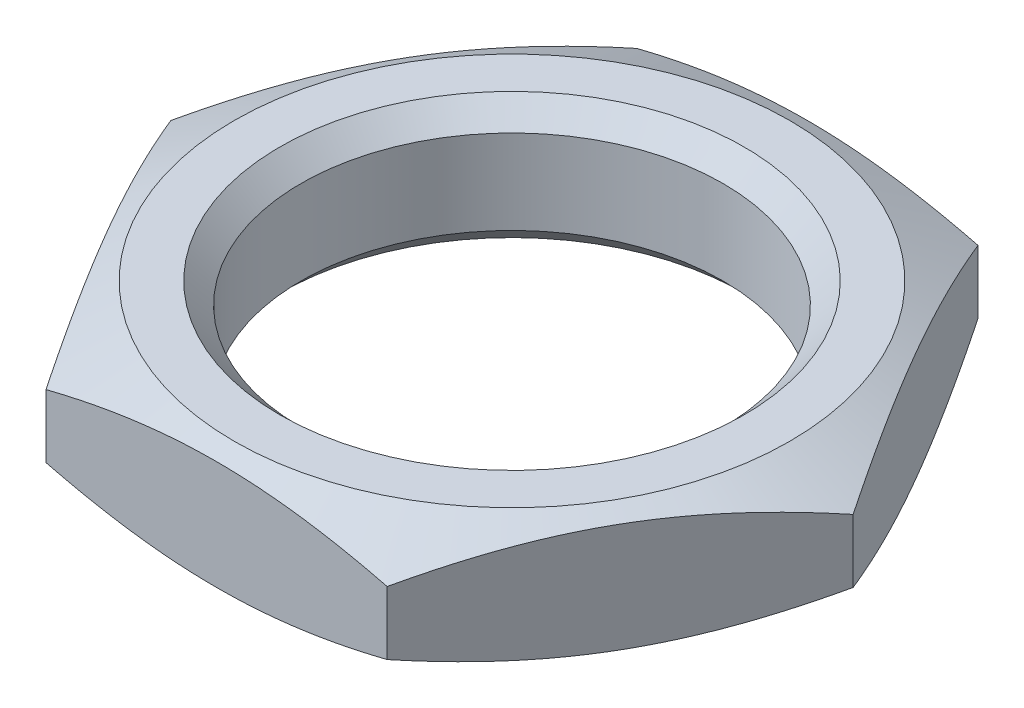
ISO-10303-21;
HEADER;
FILE_DESCRIPTION(('STEP AP214'),'2;1');
FILE_NAME('part.step','',(''),(''),'','','');
FILE_SCHEMA(('AUTOMOTIVE_DESIGN { 1 0 10303 214 1 1 1 1 }'));
ENDSEC;
DATA;
#1=APPLICATION_CONTEXT('core data for automotive mechanical design processes');
#2=APPLICATION_PROTOCOL_DEFINITION('international standard','automotive_design',2000,#1);
#3=PRODUCT_CONTEXT('',#1,'mechanical');
#4=PRODUCT('Part','Part','',(#3));
#5=PRODUCT_RELATED_PRODUCT_CATEGORY('part','',(#4));
#6=PRODUCT_DEFINITION_FORMATION('','',#4);
#7=PRODUCT_DEFINITION_CONTEXT('part definition',#1,'design');
#8=PRODUCT_DEFINITION('design','',#6,#7);
#9=PRODUCT_DEFINITION_SHAPE('','',#8);
#10=(LENGTH_UNIT() NAMED_UNIT(*) SI_UNIT(.MILLI.,.METRE.));
#11=(NAMED_UNIT(*) PLANE_ANGLE_UNIT() SI_UNIT($,.RADIAN.));
#12=(NAMED_UNIT(*) SI_UNIT($,.STERADIAN.) SOLID_ANGLE_UNIT());
#13=UNCERTAINTY_MEASURE_WITH_UNIT(LENGTH_MEASURE(1.E-05),#10,'distance_accuracy_value','');
#14=(GEOMETRIC_REPRESENTATION_CONTEXT(3) GLOBAL_UNCERTAINTY_ASSIGNED_CONTEXT((#13)) GLOBAL_UNIT_ASSIGNED_CONTEXT((#10,
#11,#12)) REPRESENTATION_CONTEXT('',''));
#15=CARTESIAN_POINT('',(0.,0.,0.));
#16=DIRECTION('',(0.,0.,1.));
#17=DIRECTION('',(1.,0.,0.));
#18=AXIS2_PLACEMENT_3D('',#15,#16,#17);
#19=CARTESIAN_POINT('',(0.,1.5,0.));
#20=DIRECTION('',(0.,1.,0.));
#21=DIRECTION('',(0.,0.,1.));
#22=AXIS2_PLACEMENT_3D('',#19,#20,#21);
#23=PLANE('',#22);
#24=CARTESIAN_POINT('',(0.,1.5,0.));
#25=DIRECTION('',(0.,1.,0.));
#26=DIRECTION('',(0.,0.,1.));
#27=AXIS2_PLACEMENT_3D('',#24,#25,#26);
#28=CIRCLE('',#27,5.5);
#29=CARTESIAN_POINT('',(0.,1.5,5.5));
#30=VERTEX_POINT('',#29);
#31=EDGE_CURVE('E11',#30,#30,#28,.F.);
#32=ORIENTED_EDGE('',*,*,#31,.T.);
#33=EDGE_LOOP('',(#32));
#34=FACE_BOUND('',#33,.T.);
#35=CARTESIAN_POINT('',(0.,1.50000000000006,0.));
#36=DIRECTION('',(0.,-1.,0.));
#37=DIRECTION('',(1.,0.,0.));
#38=AXIS2_PLACEMENT_3D('',#35,#36,#37);
#39=CIRCLE('',#38,6.58290376865476);
#40=CARTESIAN_POINT('',(6.58290376865475,1.50000000000008,0.));
#41=VERTEX_POINT('',#40);
#42=EDGE_CURVE('E218',#41,#41,#39,.T.);
#43=ORIENTED_EDGE('',*,*,#42,.F.);
#44=EDGE_LOOP('',(#43));
#45=FACE_BOUND('',#44,.T.);
#46=ADVANCED_FACE('F35',(#34,#45),#23,.T.);
#47=CARTESIAN_POINT('',(0.,-1.5,0.));
#48=DIRECTION('',(0.,1.,0.));
#49=DIRECTION('',(0.,0.,1.));
#50=AXIS2_PLACEMENT_3D('',#47,#48,#49);
#51=PLANE('',#50);
#52=CARTESIAN_POINT('',(0.,-1.5,0.));
#53=DIRECTION('',(0.,1.,0.));
#54=DIRECTION('',(0.,0.,1.));
#55=AXIS2_PLACEMENT_3D('',#52,#53,#54);
#56=CIRCLE('',#55,5.5);
#57=CARTESIAN_POINT('',(0.,-1.5,5.5));
#58=VERTEX_POINT('',#57);
#59=EDGE_CURVE('E239',#58,#58,#56,.T.);
#60=ORIENTED_EDGE('',*,*,#59,.T.);
#61=EDGE_LOOP('',(#60));
#62=FACE_BOUND('',#61,.T.);
#63=CARTESIAN_POINT('',(0.,-1.49999999999995,0.));
#64=DIRECTION('',(0.,-1.,0.));
#65=DIRECTION('',(1.,0.,0.));
#66=AXIS2_PLACEMENT_3D('',#63,#64,#65);
#67=CIRCLE('',#66,6.58290376865477);
#68=CARTESIAN_POINT('',(6.58290376865477,-1.49999999999992,0.));
#69=VERTEX_POINT('',#68);
#70=EDGE_CURVE('E221',#69,#69,#67,.T.);
#71=ORIENTED_EDGE('',*,*,#70,.T.);
#72=EDGE_LOOP('',(#71));
#73=FACE_BOUND('',#72,.T.);
#74=ADVANCED_FACE('F228',(#62,#73),#51,.F.);
#75=CARTESIAN_POINT('',(0.,1.5,0.));
#76=DIRECTION('',(0.,-1.,0.));
#77=DIRECTION('',(0.,0.,-1.));
#78=AXIS2_PLACEMENT_3D('',#75,#76,#77);
#79=CYLINDRICAL_SURFACE('',#78,5.);
#80=CARTESIAN_POINT('',(0.,-0.999999999999997,0.));
#81=DIRECTION('',(0.,1.,0.));
#82=DIRECTION('',(0.,0.,1.));
#83=AXIS2_PLACEMENT_3D('',#80,#81,#82);
#84=CIRCLE('',#83,5.);
#85=CARTESIAN_POINT('',(0.,-0.999999999999997,5.));
#86=VERTEX_POINT('',#85);
#87=EDGE_CURVE('E44',#86,#86,#84,.F.);
#88=ORIENTED_EDGE('',*,*,#87,.T.);
#89=EDGE_LOOP('',(#88));
#90=FACE_BOUND('',#89,.T.);
#91=CARTESIAN_POINT('',(0.,1.,0.));
#92=DIRECTION('',(0.,1.,0.));
#93=DIRECTION('',(0.,0.,1.));
#94=AXIS2_PLACEMENT_3D('',#91,#92,#93);
#95=CIRCLE('',#94,5.);
#96=CARTESIAN_POINT('',(0.,1.,5.));
#97=VERTEX_POINT('',#96);
#98=EDGE_CURVE('E241',#97,#97,#95,.T.);
#99=ORIENTED_EDGE('',*,*,#98,.T.);
#100=EDGE_LOOP('',(#99));
#101=FACE_BOUND('',#100,.T.);
#102=ADVANCED_FACE('F137',(#90,#101),#79,.F.);
#103=CARTESIAN_POINT('',(0.,-1.49999999999995,0.));
#104=DIRECTION('',(0.,1.,0.));
#105=DIRECTION('',(-1.,0.,0.));
#106=AXIS2_PLACEMENT_3D('',#103,#104,#105);
#107=CONICAL_SURFACE('',#106,6.58290376865477,1.10714871779413);
#108=ORIENTED_EDGE('',*,*,#70,.F.);
#109=EDGE_LOOP('',(#108));
#110=FACE_BOUND('',#109,.T.);
#111=CARTESIAN_POINT('',(8.0830192387086,-0.749942263735924,-0.00020000000000194));
#112=CARTESIAN_POINT('',(7.96911063811085,-0.80689479107601,0.197095483654374));
#113=CARTESIAN_POINT('',(7.85475826005872,-0.860467497783486,0.395159612406992));
#114=CARTESIAN_POINT('',(7.62514268532099,-0.959725133654418,0.792865454061861));
#115=CARTESIAN_POINT('',(7.5098790513341,-1.0054060008345,0.99250792439217));
#116=CARTESIAN_POINT('',(7.27836347043434,-1.08775189443212,1.39350467325438));
#117=CARTESIAN_POINT('',(7.16211031317627,-1.12440347571233,1.59486104816565));
#118=CARTESIAN_POINT('',(6.92892558280145,-1.18747346203902,1.99874884872409));
#119=CARTESIAN_POINT('',(6.81199413014762,-1.21389363088953,2.20128006572336));
#120=CARTESIAN_POINT('',(6.58028678901038,-1.25510632519904,2.60260895305975));
#121=CARTESIAN_POINT('',(6.46552213318135,-1.27014888729389,2.80138716786879));
#122=CARTESIAN_POINT('',(6.23575392156505,-1.28902103459189,3.19935738435246));
#123=CARTESIAN_POINT('',(6.12075035427495,-1.29285006676126,3.39854940595059));
#124=CARTESIAN_POINT('',(5.89091366875913,-1.28914666140749,3.79663822270721));
#125=CARTESIAN_POINT('',(5.77608050040106,-1.28162646239697,3.99553510469749));
#126=CARTESIAN_POINT('',(5.54674144035722,-1.25553701213599,4.39276200885352));
#127=CARTESIAN_POINT('',(5.43223552160612,-1.2369687028555,4.59109207789778));
#128=CARTESIAN_POINT('',(5.21095699272856,-1.19095107911366,4.97435773253781));
#129=CARTESIAN_POINT('',(5.10415103826671,-1.16413392511419,5.15935107221662));
#130=CARTESIAN_POINT('',(4.89113911057211,-1.10215041122329,5.52829855360185));
#131=CARTESIAN_POINT('',(4.78493320259187,-1.0669831605285,5.71225258228761));
#132=CARTESIAN_POINT('',(4.57203465806545,-0.988740933573034,6.08100367826484));
#133=CARTESIAN_POINT('',(4.46534979998294,-0.94558215180533,6.26578727286203));
#134=CARTESIAN_POINT('',(4.25276290273529,-0.852561439209896,6.63399857991837));
#135=CARTESIAN_POINT('',(4.14686052183818,-0.802702642464108,6.81742688427469));
#136=CARTESIAN_POINT('',(4.04133641427354,-0.749942263735935,7.0002));
#137=B_SPLINE_CURVE_WITH_KNOTS('',3,(#111,#112,#113,#114,#115,#116,#117,#118,#119,#120,#121,
#122,#123,#124,#125,#126,#127,#128,#129,#130,#131,#132,#133,#134,#135,#136),.UNSPECIFIED.,.F.,
.F.,(4,2,2,2,2,2,2,2,2,2,2,2,4),(0.,0.704520495679845,1.40940253941608,2.11532793441148,
2.82113157994814,3.51093357080248,4.20076958104177,4.88986223376538,5.57889614236258,
6.22458481843734,6.87034240871697,7.52330078060662,8.17595477297031),.UNSPECIFIED.);
#138=CARTESIAN_POINT('',(8.08290376865476,-0.750000000000001,0.));
#139=VERTEX_POINT('',#138);
#140=CARTESIAN_POINT('',(4.04145188432738,-0.750000000000028,7.));
#141=VERTEX_POINT('',#140);
#142=EDGE_CURVE('E59',#139,#141,#137,.T.);
#143=ORIENTED_EDGE('',*,*,#142,.T.);
#144=CARTESIAN_POINT('',(12.1592767422112,2.22367482325355,7.00000000000001));
#145=CARTESIAN_POINT('',(11.8162558283714,2.07507396338311,7.00000000000001));
#146=CARTESIAN_POINT('',(11.4726833356507,1.92772653262183,7.00000000000001));
#147=CARTESIAN_POINT('',(10.7841202885016,1.63628290510384,7.00000000000001));
#148=CARTESIAN_POINT('',(10.4391295866552,1.49218705698574,7.00000000000001));
#149=CARTESIAN_POINT('',(9.74639118637226,1.20757225274028,7.00000000000001));
#150=CARTESIAN_POINT('',(9.39863821359778,1.0670660946992,7.00000000000001));
#151=CARTESIAN_POINT('',(8.70110658723336,0.791192248242292,7.00000000000001));
#152=CARTESIAN_POINT('',(8.35132799898798,0.655824395121876,7.));
#153=CARTESIAN_POINT('',(7.64948082320806,0.391722002755986,7.));
#154=CARTESIAN_POINT('',(7.29741358678882,0.26298389057082,7.));
#155=CARTESIAN_POINT('',(6.59025569503633,0.0139723559351722,7.));
#156=CARTESIAN_POINT('',(6.23516483956304,-0.106300501221508,7.));
#157=CARTESIAN_POINT('',(5.52166592608259,-0.335718879290078,7.));
#158=CARTESIAN_POINT('',(5.16326063737769,-0.444872909747485,7.));
#159=CARTESIAN_POINT('',(4.44242923537567,-0.648783572666439,7.));
#160=CARTESIAN_POINT('',(4.08000378435454,-0.743542539836649,7.));
#161=CARTESIAN_POINT('',(3.23037691133671,-0.942674720970054,7.));
#162=CARTESIAN_POINT('',(2.74141800984099,-1.03992431336618,7.));
#163=CARTESIAN_POINT('',(2.00315262342714,-1.15284938024153,7.));
#164=CARTESIAN_POINT('',(1.75633622502393,-1.18499469491032,7.));
#165=CARTESIAN_POINT('',(1.26140195287719,-1.23713495868264,7.));
#166=CARTESIAN_POINT('',(1.01328410608341,-1.25713015839068,7.));
#167=CARTESIAN_POINT('',(0.516679390404971,-1.28409788379309,7.));
#168=CARTESIAN_POINT('',(0.268193509861501,-1.29108842348662,7.));
#169=CARTESIAN_POINT('',(-0.228795778601232,-1.29178762770126,7.));
#170=CARTESIAN_POINT('',(-0.477299186394229,-1.28549637973016,7.));
#171=CARTESIAN_POINT('',(-0.973703807438946,-1.25991121574788,7.));
#172=CARTESIAN_POINT('',(-1.22160481467715,-1.24061334784038,7.));
#173=CARTESIAN_POINT('',(-1.71614257485178,-1.18983700049047,7.));
#174=CARTESIAN_POINT('',(-1.962779276657,-1.15835803229533,7.));
#175=CARTESIAN_POINT('',(-2.63714359574246,-1.05689653876842,7.));
#176=CARTESIAN_POINT('',(-3.06319197996883,-0.975687119661644,7.));
#177=CARTESIAN_POINT('',(-3.90946735611964,-0.787082735680695,7.));
#178=CARTESIAN_POINT('',(-4.32969137717643,-0.679674892068304,7.));
#179=CARTESIAN_POINT('',(-5.16611518957786,-0.444943871410967,7.));
#180=CARTESIAN_POINT('',(-5.58229466954457,-0.317549368249395,7.));
#181=CARTESIAN_POINT('',(-6.40983521694612,-0.048370360191169,7.));
#182=CARTESIAN_POINT('',(-6.82119709891921,0.093411671772737,7.));
#183=CARTESIAN_POINT('',(-7.64937170751498,0.390925026545968,7.));
#184=CARTESIAN_POINT('',(-8.06609629712318,0.546899882866053,7.));
#185=CARTESIAN_POINT('',(-8.89638604815283,0.86708008102002,7.));
#186=CARTESIAN_POINT('',(-9.30995098797936,1.03128599412376,7.));
#187=CARTESIAN_POINT('',(-10.1306186757083,1.3642882570419,7.));
#188=CARTESIAN_POINT('',(-10.5377454038288,1.53302570877317,7.));
#189=CARTESIAN_POINT('',(-11.1469111057061,1.78961417356815,7.));
#190=CARTESIAN_POINT('',(-11.3496906999091,1.87571466196836,7.));
#191=CARTESIAN_POINT('',(-11.7548045094598,2.04895073335853,7.));
#192=CARTESIAN_POINT('',(-11.9571387301276,2.13608630390362,7.));
#193=CARTESIAN_POINT('',(-12.1592767422112,2.22367482325346,7.));
#194=B_SPLINE_CURVE_WITH_KNOTS('',3,(#144,#145,#146,#147,#148,#149,#150,#151,#152,#153,#154,
#155,#156,#157,#158,#159,#160,#161,#162,#163,#164,#165,#166,#167,#168,#169,#170,#171,#172,#173,
#174,#175,#176,#177,#178,#179,#180,#181,#182,#183,#184,#185,#186,#187,#188,#189,#190,#191,#192,
#193),.UNSPECIFIED.,.F.,.F.,(4,2,2,2,2,2,2,2,2,2,2,2,2,2,2,2,2,2,2,2,2,2,2,2,4),(0.,
1.12148600624007,2.24309169361877,3.36825570172611,4.49338361301966,5.61789867806737,
6.74248876500856,7.86621160137316,8.98975198818042,10.4835735923571,11.2300258734726,
11.9764627579722,12.7218649091997,13.4672621493196,14.2128859710843,14.9585397132558,
16.2585125867825,17.5591257992711,18.8644907431542,20.1696316993349,21.5043895358689,
22.8392401388062,24.1613285099584,24.8222315468664,25.4831266457093),.UNSPECIFIED.);
#195=CARTESIAN_POINT('',(-4.04145188432738,-0.750000000000042,7.));
#196=VERTEX_POINT('',#195);
#197=EDGE_CURVE('E108',#141,#196,#194,.T.);
#198=ORIENTED_EDGE('',*,*,#197,.T.);
#199=CARTESIAN_POINT('',(-4.04133641427354,-0.749942263735962,7.0002));
#200=CARTESIAN_POINT('',(-4.1552450148713,-0.806894791076049,6.80290451634562));
#201=CARTESIAN_POINT('',(-4.26959739292343,-0.860467497783525,6.60484038759301));
#202=CARTESIAN_POINT('',(-4.49921296766115,-0.959725133654457,6.20713454593814));
#203=CARTESIAN_POINT('',(-4.61447660164804,-1.00540600083454,6.00749207560783));
#204=CARTESIAN_POINT('',(-4.84599218254781,-1.08775189443216,5.60649532674561));
#205=CARTESIAN_POINT('',(-4.96224533980587,-1.12440347571237,5.40513895183434));
#206=CARTESIAN_POINT('',(-5.19543007018069,-1.18747346203905,5.00125115127591));
#207=CARTESIAN_POINT('',(-5.31236152283453,-1.21389363088956,4.79871993427663));
#208=CARTESIAN_POINT('',(-5.54406886397176,-1.25510632519908,4.39739104694024));
#209=CARTESIAN_POINT('',(-5.6588335198008,-1.27014888729392,4.1986128321312));
#210=CARTESIAN_POINT('',(-5.8886017314171,-1.28902103459193,3.80064261564753));
#211=CARTESIAN_POINT('',(-6.0036052987072,-1.29285006676129,3.6014505940494));
#212=CARTESIAN_POINT('',(-6.23344198422302,-1.28914666140753,3.20336177729278));
#213=CARTESIAN_POINT('',(-6.34827515258109,-1.28162646239701,3.00446489530249));
#214=CARTESIAN_POINT('',(-6.57761421262493,-1.25553701213603,2.60723799114646));
#215=CARTESIAN_POINT('',(-6.69212013137603,-1.23696870285553,2.40890792210221));
#216=CARTESIAN_POINT('',(-6.91339866025359,-1.1909510791137,2.02564226746218));
#217=CARTESIAN_POINT('',(-7.02020461471544,-1.16413392511422,1.84064892778337));
#218=CARTESIAN_POINT('',(-7.23321654241004,-1.10215041122332,1.47170144639814));
#219=CARTESIAN_POINT('',(-7.33942245039027,-1.06698316052854,1.28774741771238));
#220=CARTESIAN_POINT('',(-7.5523209949167,-0.988740933573071,0.918996321735153));
#221=CARTESIAN_POINT('',(-7.65900585299921,-0.945582151805368,0.734212727137971));
#222=CARTESIAN_POINT('',(-7.87159275024685,-0.852561439209934,0.36600142008163));
#223=CARTESIAN_POINT('',(-7.97749513114397,-0.802702642464147,0.182573115725312));
#224=CARTESIAN_POINT('',(-8.0830192387086,-0.749942263735975,-0.000199999999999234));
#225=B_SPLINE_CURVE_WITH_KNOTS('',3,(#199,#200,#201,#202,#203,#204,#205,#206,#207,#208,#209,
#210,#211,#212,#213,#214,#215,#216,#217,#218,#219,#220,#221,#222,#223,#224),.UNSPECIFIED.,.F.,
.F.,(4,2,2,2,2,2,2,2,2,2,2,2,4),(0.,0.704520495679848,1.40940253941608,2.11532793441148,
2.82113157994815,3.51093357080249,4.20076958104178,4.8898622337654,5.57889614236259,
6.22458481843736,6.87034240871698,7.52330078060662,8.1759547729703),.UNSPECIFIED.);
#226=CARTESIAN_POINT('',(-8.08290376865476,-0.750000000000056,5.9314532452337E-12));
#227=VERTEX_POINT('',#226);
#228=EDGE_CURVE('E146',#196,#227,#225,.T.);
#229=ORIENTED_EDGE('',*,*,#228,.T.);
#230=CARTESIAN_POINT('',(-8.0830192387086,-0.749942263735975,0.000200000000000181));
#231=CARTESIAN_POINT('',(-7.96911063811085,-0.806894791076061,-0.197095483654377));
#232=CARTESIAN_POINT('',(-7.85475826005872,-0.860467497783537,-0.395159612406995));
#233=CARTESIAN_POINT('',(-7.62514268532099,-0.959725133654467,-0.792865454061865));
#234=CARTESIAN_POINT('',(-7.5098790513341,-1.00540600083455,-0.992507924392175));
#235=CARTESIAN_POINT('',(-7.27836347043434,-1.08775189443217,-1.39350467325439));
#236=CARTESIAN_POINT('',(-7.16211031317627,-1.12440347571238,-1.59486104816566));
#237=CARTESIAN_POINT('',(-6.92892558280145,-1.18747346203906,-1.99874884872409));
#238=CARTESIAN_POINT('',(-6.81199413014762,-1.21389363088957,-2.20128006572337));
#239=CARTESIAN_POINT('',(-6.58028678901038,-1.25510632519909,-2.60260895305976));
#240=CARTESIAN_POINT('',(-6.46552213318134,-1.27014888729393,-2.8013871678688));
#241=CARTESIAN_POINT('',(-6.23575392156504,-1.28902103459193,-3.19935738435247));
#242=CARTESIAN_POINT('',(-6.12075035427494,-1.29285006676129,-3.3985494059506));
#243=CARTESIAN_POINT('',(-5.89091366875913,-1.28914666140753,-3.79663822270722));
#244=CARTESIAN_POINT('',(-5.77608050040106,-1.28162646239701,-3.99553510469751));
#245=CARTESIAN_POINT('',(-5.54674144035721,-1.25553701213603,-4.39276200885354));
#246=CARTESIAN_POINT('',(-5.43223552160611,-1.23696870285553,-4.5910920778978));
#247=CARTESIAN_POINT('',(-5.21095699272855,-1.19095107911369,-4.97435773253782));
#248=CARTESIAN_POINT('',(-5.1041510382667,-1.16413392511422,-5.15935107221663));
#249=CARTESIAN_POINT('',(-4.89113911057211,-1.10215041122332,-5.52829855360187));
#250=CARTESIAN_POINT('',(-4.78493320259187,-1.06698316052853,-5.71225258228762));
#251=CARTESIAN_POINT('',(-4.57203465806545,-0.988740933573063,-6.08100367826485));
#252=CARTESIAN_POINT('',(-4.46534979998294,-0.945582151805358,-6.26578727286203));
#253=CARTESIAN_POINT('',(-4.25276290273529,-0.852561439209923,-6.63399857991837));
#254=CARTESIAN_POINT('',(-4.14686052183818,-0.802702642464135,-6.81742688427469));
#255=CARTESIAN_POINT('',(-4.04133641427354,-0.749942263735962,-7.0002));
#256=B_SPLINE_CURVE_WITH_KNOTS('',3,(#230,#231,#232,#233,#234,#235,#236,#237,#238,#239,#240,
#241,#242,#243,#244,#245,#246,#247,#248,#249,#250,#251,#252,#253,#254,#255),.UNSPECIFIED.,.F.,
.F.,(4,2,2,2,2,2,2,2,2,2,2,2,4),(0.,0.704520495679847,1.40940253941608,2.11532793441148,
2.82113157994815,3.51093357080249,4.20076958104178,4.8898622337654,5.57889614236259,
6.22458481843736,6.87034240871698,7.52330078060662,8.1759547729703),.UNSPECIFIED.);
#257=CARTESIAN_POINT('',(-4.04145188433251,-0.750000000000042,-6.99999999999704));
#258=VERTEX_POINT('',#257);
#259=EDGE_CURVE('E154',#227,#258,#256,.T.);
#260=ORIENTED_EDGE('',*,*,#259,.T.);
#261=CARTESIAN_POINT('',(-12.1592767422112,2.22367482325346,-7.));
#262=CARTESIAN_POINT('',(-11.8162558283714,2.07507396338303,-7.));
#263=CARTESIAN_POINT('',(-11.4726833356507,1.92772653262174,-7.));
#264=CARTESIAN_POINT('',(-10.7841202885016,1.63628290510376,-7.));
#265=CARTESIAN_POINT('',(-10.4391295866552,1.49218705698566,-7.));
#266=CARTESIAN_POINT('',(-9.74639118637225,1.2075722527402,-7.));
#267=CARTESIAN_POINT('',(-9.39863821359777,1.06706609469913,-7.));
#268=CARTESIAN_POINT('',(-8.70110658723335,0.791192248242226,-7.));
#269=CARTESIAN_POINT('',(-8.35132799898797,0.655824395121811,-7.));
#270=CARTESIAN_POINT('',(-7.64948082320804,0.391722002755926,-7.));
#271=CARTESIAN_POINT('',(-7.29741358678881,0.262983890570763,-7.));
#272=CARTESIAN_POINT('',(-6.59025569503632,0.0139723559351216,-7.));
#273=CARTESIAN_POINT('',(-6.23516483956302,-0.106300501221556,-7.));
#274=CARTESIAN_POINT('',(-5.52166592608258,-0.33571887929012,-7.));
#275=CARTESIAN_POINT('',(-5.16326063737767,-0.444872909747523,-7.));
#276=CARTESIAN_POINT('',(-4.44242923537565,-0.648783572666472,-7.));
#277=CARTESIAN_POINT('',(-4.08000378435452,-0.74354253983668,-7.));
#278=CARTESIAN_POINT('',(-3.2303769113367,-0.942674720970079,-7.));
#279=CARTESIAN_POINT('',(-2.74141800984098,-1.0399243133662,-7.));
#280=CARTESIAN_POINT('',(-2.00315262342713,-1.15284938024155,-7.));
#281=CARTESIAN_POINT('',(-1.75633622502391,-1.18499469491033,-7.));
#282=CARTESIAN_POINT('',(-1.26140195287717,-1.23713495868265,-7.));
#283=CARTESIAN_POINT('',(-1.01328410608339,-1.25713015839069,-7.));
#284=CARTESIAN_POINT('',(-0.516679390404958,-1.28409788379309,-7.));
#285=CARTESIAN_POINT('',(-0.268193509861488,-1.29108842348662,-7.));
#286=CARTESIAN_POINT('',(0.228795778601245,-1.29178762770126,-7.));
#287=CARTESIAN_POINT('',(0.477299186394242,-1.28549637973016,-7.));
#288=CARTESIAN_POINT('',(0.973703807438959,-1.25991121574787,-7.));
#289=CARTESIAN_POINT('',(1.22160481467717,-1.24061334784037,-7.));
#290=CARTESIAN_POINT('',(1.71614257485179,-1.18983700049046,-7.));
#291=CARTESIAN_POINT('',(1.96277927665701,-1.15835803229531,-7.));
#292=CARTESIAN_POINT('',(2.63714359574247,-1.05689653876841,-7.));
#293=CARTESIAN_POINT('',(3.06319197996884,-0.975687119661622,-7.));
#294=CARTESIAN_POINT('',(3.90946735611965,-0.787082735680666,-7.));
#295=CARTESIAN_POINT('',(4.32969137717645,-0.679674892068271,-7.));
#296=CARTESIAN_POINT('',(5.16611518957788,-0.444943871410928,-7.));
#297=CARTESIAN_POINT('',(5.58229466954458,-0.317549368249352,-7.));
#298=CARTESIAN_POINT('',(6.40983521694613,-0.0483703601911204,-7.));
#299=CARTESIAN_POINT('',(6.82119709891923,0.0934116717727886,-7.));
#300=CARTESIAN_POINT('',(7.64937170751499,0.390925026546025,-7.));
#301=CARTESIAN_POINT('',(8.06609629712319,0.546899882866113,-7.));
#302=CARTESIAN_POINT('',(8.89638604815284,0.867080081020087,-7.));
#303=CARTESIAN_POINT('',(9.30995098797937,1.03128599412383,-7.));
#304=CARTESIAN_POINT('',(10.1306186757083,1.36428825704197,-7.));
#305=CARTESIAN_POINT('',(10.5377454038288,1.53302570877325,-7.));
#306=CARTESIAN_POINT('',(11.1469111057061,1.78961417356823,-7.));
#307=CARTESIAN_POINT('',(11.3496906999091,1.87571466196845,-7.));
#308=CARTESIAN_POINT('',(11.7548045094598,2.04895073335862,-7.));
#309=CARTESIAN_POINT('',(11.9571387301276,2.1360863039037,-7.));
#310=CARTESIAN_POINT('',(12.1592767422112,2.22367482325355,-7.));
#311=B_SPLINE_CURVE_WITH_KNOTS('',3,(#261,#262,#263,#264,#265,#266,#267,#268,#269,#270,#271,
#272,#273,#274,#275,#276,#277,#278,#279,#280,#281,#282,#283,#284,#285,#286,#287,#288,#289,#290,
#291,#292,#293,#294,#295,#296,#297,#298,#299,#300,#301,#302,#303,#304,#305,#306,#307,#308,#309,
#310),.UNSPECIFIED.,.F.,.F.,(4,2,2,2,2,2,2,2,2,2,2,2,2,2,2,2,2,2,2,2,2,2,2,2,4),(0.,
1.12148600624007,2.24309169361877,3.36825570172611,4.49338361301966,5.61789867806736,
6.74248876500856,7.86621160137315,8.98975198818041,10.4835735923571,11.2300258734726,
11.9764627579722,12.7218649091997,13.4672621493196,14.2128859710843,14.9585397132558,
16.2585125867825,17.5591257992711,18.8644907431542,20.1696316993349,21.5043895358689,
22.8392401388062,24.1613285099584,24.8222315468664,25.4831266457093),.UNSPECIFIED.);
#312=CARTESIAN_POINT('',(4.04145188432739,-0.750000000000015,-7.));
#313=VERTEX_POINT('',#312);
#314=EDGE_CURVE('E90',#258,#313,#311,.T.);
#315=ORIENTED_EDGE('',*,*,#314,.T.);
#316=CARTESIAN_POINT('',(4.04133641427354,-0.749942263735936,-7.0002));
#317=CARTESIAN_POINT('',(4.15524501487129,-0.806894791076022,-6.80290451634562));
#318=CARTESIAN_POINT('',(4.26959739292343,-0.860467497783498,-6.60484038759301));
#319=CARTESIAN_POINT('',(4.49921296766115,-0.959725133654428,-6.20713454593814));
#320=CARTESIAN_POINT('',(4.61447660164804,-1.00540600083451,-6.00749207560783));
#321=CARTESIAN_POINT('',(4.8459921825478,-1.08775189443213,-5.60649532674561));
#322=CARTESIAN_POINT('',(4.96224533980587,-1.12440347571234,-5.40513895183435));
#323=CARTESIAN_POINT('',(5.19543007018069,-1.18747346203902,-5.00125115127591));
#324=CARTESIAN_POINT('',(5.31236152283452,-1.21389363088953,-4.79871993427663));
#325=CARTESIAN_POINT('',(5.54406886397176,-1.25510632519905,-4.39739104694025));
#326=CARTESIAN_POINT('',(5.65883351980079,-1.27014888729389,-4.19861283213121));
#327=CARTESIAN_POINT('',(5.88860173141709,-1.28902103459189,-3.80064261564754));
#328=CARTESIAN_POINT('',(6.0036052987072,-1.29285006676126,-3.60145059404941));
#329=CARTESIAN_POINT('',(6.23344198422301,-1.28914666140749,-3.20336177729279));
#330=CARTESIAN_POINT('',(6.34827515258108,-1.28162646239697,-3.0044648953025));
#331=CARTESIAN_POINT('',(6.57761421262493,-1.25553701213599,-2.60723799114647));
#332=CARTESIAN_POINT('',(6.69212013137602,-1.23696870285549,-2.40890792210222));
#333=CARTESIAN_POINT('',(6.91339866025358,-1.19095107911366,-2.02564226746219));
#334=CARTESIAN_POINT('',(7.02020461471543,-1.16413392511418,-1.84064892778338));
#335=CARTESIAN_POINT('',(7.23321654241003,-1.10215041122328,-1.47170144639814));
#336=CARTESIAN_POINT('',(7.33942245039027,-1.0669831605285,-1.28774741771239));
#337=CARTESIAN_POINT('',(7.55232099491669,-0.988740933573025,-0.918996321735159));
#338=CARTESIAN_POINT('',(7.6590058529992,-0.94558215180532,-0.734212727137975));
#339=CARTESIAN_POINT('',(7.87159275024685,-0.852561439209885,-0.366001420081633));
#340=CARTESIAN_POINT('',(7.97749513114396,-0.802702642464097,-0.182573115725314));
#341=CARTESIAN_POINT('',(8.0830192387086,-0.749942263735923,0.000199999999998805));
#342=B_SPLINE_CURVE_WITH_KNOTS('',3,(#316,#317,#318,#319,#320,#321,#322,#323,#324,#325,#326,
#327,#328,#329,#330,#331,#332,#333,#334,#335,#336,#337,#338,#339,#340,#341),.UNSPECIFIED.,.F.,
.F.,(4,2,2,2,2,2,2,2,2,2,2,2,4),(0.,0.704520495679845,1.40940253941608,2.11532793441148,
2.82113157994814,3.51093357080248,4.20076958104177,4.88986223376539,5.57889614236258,
6.22458481843734,6.87034240871697,7.52330078060661,8.1759547729703),.UNSPECIFIED.);
#343=EDGE_CURVE('E87',#313,#139,#342,.T.);
#344=ORIENTED_EDGE('',*,*,#343,.T.);
#345=EDGE_LOOP('',(#143,#198,#229,#260,#315,#344));
#346=FACE_BOUND('',#345,.T.);
#347=ADVANCED_FACE('F88',(#110,#346),#107,.T.);
#348=CARTESIAN_POINT('',(0.,0.750000000000028,0.));
#349=DIRECTION('',(0.,-1.,0.));
#350=DIRECTION('',(1.,0.,0.));
#351=AXIS2_PLACEMENT_3D('',#348,#349,#350);
#352=CONICAL_SURFACE('',#351,8.08290376865476,1.10714871779408);
#353=ORIENTED_EDGE('',*,*,#42,.T.);
#354=EDGE_LOOP('',(#353));
#355=FACE_BOUND('',#354,.T.);
#356=CARTESIAN_POINT('',(4.04133641427354,0.74994226373596,7.0002));
#357=CARTESIAN_POINT('',(4.15524501487128,0.806894791076047,6.80290451634566));
#358=CARTESIAN_POINT('',(4.26959739292339,0.860467497783524,6.60484038759307));
#359=CARTESIAN_POINT('',(4.49921296766108,0.959725133654458,6.20713454593825));
#360=CARTESIAN_POINT('',(4.61447660164795,1.00540600083454,6.00749207560797));
#361=CARTESIAN_POINT('',(4.84599218254769,1.08775189443217,5.60649532674581));
#362=CARTESIAN_POINT('',(4.96224533980574,1.12440347571238,5.40513895183457));
#363=CARTESIAN_POINT('',(5.19543007018052,1.18747346203907,5.00125115127619));
#364=CARTESIAN_POINT('',(5.31236152283434,1.21389363088959,4.79871993427695));
#365=CARTESIAN_POINT('',(5.54406886397155,1.25510632519912,4.39739104694061));
#366=CARTESIAN_POINT('',(5.65883351980056,1.27014888729397,4.1986128321316));
#367=CARTESIAN_POINT('',(5.88860173141683,1.28902103459199,3.80064261564799));
#368=CARTESIAN_POINT('',(6.00360529870692,1.29285006676137,3.60145059404989));
#369=CARTESIAN_POINT('',(6.2334419842227,1.28914666140762,3.20336177729332));
#370=CARTESIAN_POINT('',(6.34827515258076,1.28162646239711,3.00446489530306));
#371=CARTESIAN_POINT('',(6.57761421262457,1.25553701213615,2.60723799114708));
#372=CARTESIAN_POINT('',(6.69212013137565,1.23696870285567,2.40890792210286));
#373=CARTESIAN_POINT('',(6.91339866025323,1.19095107911385,2.0256422674628));
#374=CARTESIAN_POINT('',(7.02020461471511,1.16413392511437,1.84064892778393));
#375=CARTESIAN_POINT('',(7.23321654240977,1.10215041122346,1.47170144639859));
#376=CARTESIAN_POINT('',(7.33942245039004,1.06698316052866,1.28774741771277));
#377=CARTESIAN_POINT('',(7.55232099491653,0.988740933573169,0.918996321735432));
#378=CARTESIAN_POINT('',(7.65900585299908,0.94558215180545,0.734212727138193));
#379=CARTESIAN_POINT('',(7.87159275024678,0.852561439209979,0.366001420081738));
#380=CARTESIAN_POINT('',(7.97749513114393,0.80270264246417,0.182573115725365));
#381=CARTESIAN_POINT('',(8.0830192387086,0.749942263735975,-0.000200000000002315));
#382=B_SPLINE_CURVE_WITH_KNOTS('',3,(#356,#357,#358,#359,#360,#361,#362,#363,#364,#365,#366,
#367,#368,#369,#370,#371,#372,#373,#374,#375,#376,#377,#378,#379,#380,#381),.UNSPECIFIED.,.F.,
.F.,(4,2,2,2,2,2,2,2,2,2,2,2,4),(0.,0.704520495679751,1.40940253941589,2.1153279344112,
2.82113157994777,3.51093357080201,4.20076958104121,4.88986223376473,5.57889614236182,
6.22458481843678,6.8703424087166,7.52330078060645,8.17595477297033),.UNSPECIFIED.);
#383=CARTESIAN_POINT('',(4.04145188432737,0.750000000000042,7.));
#384=VERTEX_POINT('',#383);
#385=CARTESIAN_POINT('',(8.08290376865476,0.750000000000056,0.));
#386=VERTEX_POINT('',#385);
#387=EDGE_CURVE('E190',#384,#386,#382,.T.);
#388=ORIENTED_EDGE('',*,*,#387,.T.);
#389=CARTESIAN_POINT('',(8.0830192387086,0.749942263735975,0.000199999999998323));
#390=CARTESIAN_POINT('',(7.96911063811086,0.806894791076061,-0.19709548365435));
#391=CARTESIAN_POINT('',(7.85475826005875,0.860467497783537,-0.39515961240694));
#392=CARTESIAN_POINT('',(7.62514268532105,0.959725133654469,-0.792865454061753));
#393=CARTESIAN_POINT('',(7.50987905133418,1.00540600083455,-0.992507924392034));
#394=CARTESIAN_POINT('',(7.27836347043445,1.08775189443218,-1.39350467325419));
#395=CARTESIAN_POINT('',(7.1621103131764,1.12440347571239,-1.59486104816543));
#396=CARTESIAN_POINT('',(6.92892558280161,1.18747346203908,-1.99874884872381));
#397=CARTESIAN_POINT('',(6.81199413014779,1.21389363088959,-2.20128006572306));
#398=CARTESIAN_POINT('',(6.58028678901059,1.25510632519912,-2.60260895305939));
#399=CARTESIAN_POINT('',(6.46552213318157,1.27014888729397,-2.80138716786841));
#400=CARTESIAN_POINT('',(6.2357539215653,1.28902103459199,-3.19935738435202));
#401=CARTESIAN_POINT('',(6.12075035427522,1.29285006676136,-3.39854940595012));
#402=CARTESIAN_POINT('',(5.89091366875943,1.28914666140762,-3.79663822270669));
#403=CARTESIAN_POINT('',(5.77608050040138,1.28162646239711,-3.99553510469695));
#404=CARTESIAN_POINT('',(5.54674144035756,1.25553701213615,-4.39276200885292));
#405=CARTESIAN_POINT('',(5.43223552160648,1.23696870285566,-4.59109207789715));
#406=CARTESIAN_POINT('',(5.21095699272891,1.19095107911384,-4.97435773253721));
#407=CARTESIAN_POINT('',(5.10415103826703,1.16413392511436,-5.15935107221608));
#408=CARTESIAN_POINT('',(4.89113911057236,1.10215041122345,-5.52829855360142));
#409=CARTESIAN_POINT('',(4.78493320259209,1.06698316052865,-5.71225258228723));
#410=CARTESIAN_POINT('',(4.57203465806561,0.988740933573158,-6.08100367826457));
#411=CARTESIAN_POINT('',(4.46534979998306,0.945582151805438,-6.26578727286181));
#412=CARTESIAN_POINT('',(4.25276290273536,0.852561439209966,-6.63399857991826));
#413=CARTESIAN_POINT('',(4.14686052183821,0.802702642464156,-6.81742688427464));
#414=CARTESIAN_POINT('',(4.04133641427354,0.749942263735961,-7.0002));
#415=B_SPLINE_CURVE_WITH_KNOTS('',3,(#389,#390,#391,#392,#393,#394,#395,#396,#397,#398,#399,
#400,#401,#402,#403,#404,#405,#406,#407,#408,#409,#410,#411,#412,#413,#414),.UNSPECIFIED.,.F.,
.F.,(4,2,2,2,2,2,2,2,2,2,2,2,4),(0.,0.704520495679752,1.40940253941589,2.1153279344112,
2.82113157994777,3.51093357080201,4.20076958104121,4.88986223376473,5.57889614236183,
6.22458481843678,6.8703424087166,7.52330078060644,8.17595477297032),.UNSPECIFIED.);
#416=CARTESIAN_POINT('',(4.04145188432737,0.750000000000042,-7.));
#417=VERTEX_POINT('',#416);
#418=EDGE_CURVE('E107',#386,#417,#415,.T.);
#419=ORIENTED_EDGE('',*,*,#418,.T.);
#420=CARTESIAN_POINT('',(12.1592767422112,-2.22367482325389,-7.));
#421=CARTESIAN_POINT('',(11.8162558283715,-2.07507396338346,-7.));
#422=CARTESIAN_POINT('',(11.4726833356508,-1.92772653262217,-7.));
#423=CARTESIAN_POINT('',(10.7841202885018,-1.63628290510419,-7.));
#424=CARTESIAN_POINT('',(10.4391295866555,-1.49218705698609,-7.));
#425=CARTESIAN_POINT('',(9.74639118637262,-1.20757225274063,-7.));
#426=CARTESIAN_POINT('',(9.39863821359819,-1.06706609469956,-7.));
#427=CARTESIAN_POINT('',(8.70110658723388,-0.791192248242652,-7.));
#428=CARTESIAN_POINT('',(8.35132799898855,-0.655824395122235,-7.));
#429=CARTESIAN_POINT('',(7.64948082320872,-0.391722002756341,-7.));
#430=CARTESIAN_POINT('',(7.29741358678953,-0.262983890571172,-7.));
#431=CARTESIAN_POINT('',(6.59025569503714,-0.013972355935514,-7.));
#432=CARTESIAN_POINT('',(6.23516483956389,0.106300501221173,-7.));
#433=CARTESIAN_POINT('',(5.52166592608354,0.335718879289761,-7.));
#434=CARTESIAN_POINT('',(5.16326063737868,0.444872909747178,-7.));
#435=CARTESIAN_POINT('',(4.44242923537676,0.648783572666158,-7.));
#436=CARTESIAN_POINT('',(4.08000378435568,0.743542539836385,-7.));
#437=CARTESIAN_POINT('',(3.23037691133802,0.942674720969824,-7.));
#438=CARTESIAN_POINT('',(2.74141800984242,1.03992431336597,-7.));
#439=CARTESIAN_POINT('',(2.00315262342875,1.15284938024138,-7.));
#440=CARTESIAN_POINT('',(1.7563362250256,1.18499469491019,-7.));
#441=CARTESIAN_POINT('',(1.26140195287898,1.23713495868256,-7.));
#442=CARTESIAN_POINT('',(1.01328410608526,1.25713015839063,-7.));
#443=CARTESIAN_POINT('',(0.516679390406936,1.2840978837931,-7.));
#444=CARTESIAN_POINT('',(0.268193509863523,1.29108842348666,-7.));
#445=CARTESIAN_POINT('',(-0.228795778599096,1.29178762770137,-7.));
#446=CARTESIAN_POINT('',(-0.477299186392037,1.28549637973031,-7.));
#447=CARTESIAN_POINT('',(-0.973703807436644,1.2599112157481,-7.));
#448=CARTESIAN_POINT('',(-1.2216048146748,1.24061334784064,-7.));
#449=CARTESIAN_POINT('',(-1.71614257484932,1.18983700049082,-7.));
#450=CARTESIAN_POINT('',(-1.96277927665448,1.15835803229571,-7.));
#451=CARTESIAN_POINT('',(-2.63714359574,1.05689653876889,-7.));
#452=CARTESIAN_POINT('',(-3.06319197996648,0.97568711966213,-7.));
#453=CARTESIAN_POINT('',(-3.90946735611751,0.787082735681197,-7.));
#454=CARTESIAN_POINT('',(-4.32969137717441,0.679674892068799,-7.));
#455=CARTESIAN_POINT('',(-5.16611518957605,0.444943871411428,-7.));
#456=CARTESIAN_POINT('',(-5.58229466954286,0.317549368249828,-7.));
#457=CARTESIAN_POINT('',(-6.40983521694461,0.0483703601915329,-7.));
#458=CARTESIAN_POINT('',(-6.82119709891781,-0.0934116717724149,-7.));
#459=CARTESIAN_POINT('',(-7.64937170751379,-0.390925026545747,-7.));
#460=CARTESIAN_POINT('',(-8.06609629712211,-0.546899882865892,-7.));
#461=CARTESIAN_POINT('',(-8.89638604815199,-0.867080081019986,-7.));
#462=CARTESIAN_POINT('',(-9.30995098797864,-1.03128599412379,-7.));
#463=CARTESIAN_POINT('',(-10.1306186757077,-1.36428825704206,-7.));
#464=CARTESIAN_POINT('',(-10.5377454038284,-1.5330257087734,-7.));
#465=CARTESIAN_POINT('',(-11.1469111057058,-1.78961417356849,-7.));
#466=CARTESIAN_POINT('',(-11.3496906999089,-1.87571466196874,-7.));
#467=CARTESIAN_POINT('',(-11.7548045094597,-2.04895073335898,-7.));
#468=CARTESIAN_POINT('',(-11.9571387301276,-2.1360863039041,-7.));
#469=CARTESIAN_POINT('',(-12.1592767422112,-2.22367482325398,-7.));
#470=B_SPLINE_CURVE_WITH_KNOTS('',3,(#420,#421,#422,#423,#424,#425,#426,#427,#428,#429,#430,
#431,#432,#433,#434,#435,#436,#437,#438,#439,#440,#441,#442,#443,#444,#445,#446,#447,#448,#449,
#450,#451,#452,#453,#454,#455,#456,#457,#458,#459,#460,#461,#462,#463,#464,#465,#466,#467,#468,
#469),.UNSPECIFIED.,.F.,.F.,(4,2,2,2,2,2,2,2,2,2,2,2,2,2,2,2,2,2,2,2,2,2,2,2,4),(0.,
1.12148600623992,2.24309169361848,3.36825570172568,4.49338361301908,5.61789867806666,
6.74248876500773,7.8662116013722,8.98975198817932,10.4835735923557,11.230025873471,
11.9764627579704,12.7218649091978,13.4672621493175,14.212885971082,14.9585397132534,
16.2585125867804,17.5591257992692,18.8644907431527,20.1696316993337,21.5043895358681,
22.8392401388058,24.1613285099584,24.8222315468666,25.4831266457097),.UNSPECIFIED.);
#471=CARTESIAN_POINT('',(-4.04145188432738,0.750000000000015,-7.));
#472=VERTEX_POINT('',#471);
#473=EDGE_CURVE('E191',#417,#472,#470,.T.);
#474=ORIENTED_EDGE('',*,*,#473,.T.);
#475=CARTESIAN_POINT('',(-4.04133641427354,0.749942263735934,-7.0002));
#476=CARTESIAN_POINT('',(-4.15524501487128,0.80689479107602,-6.80290451634565));
#477=CARTESIAN_POINT('',(-4.26959739292339,0.860467497783496,-6.60484038759307));
#478=CARTESIAN_POINT('',(-4.49921296766108,0.959725133654429,-6.20713454593825));
#479=CARTESIAN_POINT('',(-4.61447660164795,1.00540600083451,-6.00749207560797));
#480=CARTESIAN_POINT('',(-4.84599218254769,1.08775189443214,-5.60649532674581));
#481=CARTESIAN_POINT('',(-4.96224533980574,1.12440347571235,-5.40513895183457));
#482=CARTESIAN_POINT('',(-5.19543007018052,1.18747346203904,-5.0012511512762));
#483=CARTESIAN_POINT('',(-5.31236152283434,1.21389363088956,-4.79871993427695));
#484=CARTESIAN_POINT('',(-5.54406886397155,1.25510632519909,-4.39739104694062));
#485=CARTESIAN_POINT('',(-5.65883351980056,1.27014888729393,-4.1986128321316));
#486=CARTESIAN_POINT('',(-5.88860173141683,1.28902103459195,-3.80064261564799));
#487=CARTESIAN_POINT('',(-6.00360529870692,1.29285006676133,-3.60145059404989));
#488=CARTESIAN_POINT('',(-6.2334419842227,1.28914666140758,-3.20336177729333));
#489=CARTESIAN_POINT('',(-6.34827515258076,1.28162646239707,-3.00446489530307));
#490=CARTESIAN_POINT('',(-6.57761421262457,1.25553701213611,-2.60723799114709));
#491=CARTESIAN_POINT('',(-6.69212013137565,1.23696870285563,-2.40890792210286));
#492=CARTESIAN_POINT('',(-6.91339866025323,1.1909510791138,-2.0256422674628));
#493=CARTESIAN_POINT('',(-7.02020461471511,1.16413392511433,-1.84064892778394));
#494=CARTESIAN_POINT('',(-7.23321654240977,1.10215041122341,-1.47170144639859));
#495=CARTESIAN_POINT('',(-7.33942245039004,1.06698316052862,-1.28774741771278));
#496=CARTESIAN_POINT('',(-7.55232099491653,0.988740933573121,-0.918996321735437));
#497=CARTESIAN_POINT('',(-7.65900585299908,0.9455821518054,-0.734212727138197));
#498=CARTESIAN_POINT('',(-7.87159275024678,0.852561439209927,-0.366001420081742));
#499=CARTESIAN_POINT('',(-7.97749513114393,0.802702642464118,-0.182573115725368));
#500=CARTESIAN_POINT('',(-8.0830192387086,0.749942263735921,0.000199999999999542));
#501=B_SPLINE_CURVE_WITH_KNOTS('',3,(#475,#476,#477,#478,#479,#480,#481,#482,#483,#484,#485,
#486,#487,#488,#489,#490,#491,#492,#493,#494,#495,#496,#497,#498,#499,#500),.UNSPECIFIED.,.F.,
.F.,(4,2,2,2,2,2,2,2,2,2,2,2,4),(0.,0.70452049567975,1.40940253941589,2.11532793441119,
2.82113157994776,3.510933570802,4.2007695810412,4.88986223376472,5.57889614236181,
6.22458481843677,6.8703424087166,7.52330078060644,8.17595477297033),.UNSPECIFIED.);
#502=CARTESIAN_POINT('',(-8.08290376865476,0.750000000000001,0.));
#503=VERTEX_POINT('',#502);
#504=EDGE_CURVE('E215',#472,#503,#501,.T.);
#505=ORIENTED_EDGE('',*,*,#504,.T.);
#506=CARTESIAN_POINT('',(-8.0830192387086,0.74994226373592,-0.000200000000000048));
#507=CARTESIAN_POINT('',(-7.96911063811087,0.806894791076007,0.197095483654347));
#508=CARTESIAN_POINT('',(-7.85475826005875,0.860467497783484,0.395159612406936));
#509=CARTESIAN_POINT('',(-7.62514268532106,0.959725133654419,0.792865454061748));
#510=CARTESIAN_POINT('',(-7.50987905133419,1.0054060008345,0.992507924392029));
#511=CARTESIAN_POINT('',(-7.27836347043446,1.08775189443213,1.39350467325419));
#512=CARTESIAN_POINT('',(-7.16211031317641,1.12440347571234,1.59486104816543));
#513=CARTESIAN_POINT('',(-6.92892558280162,1.18747346203904,1.9987488487238));
#514=CARTESIAN_POINT('',(-6.8119941301478,1.21389363088955,2.20128006572305));
#515=CARTESIAN_POINT('',(-6.5802867890106,1.25510632519908,2.60260895305938));
#516=CARTESIAN_POINT('',(-6.46552213318158,1.27014888729393,2.8013871678684));
#517=CARTESIAN_POINT('',(-6.23575392156531,1.28902103459195,3.19935738435201));
#518=CARTESIAN_POINT('',(-6.12075035427522,1.29285006676133,3.39854940595011));
#519=CARTESIAN_POINT('',(-5.89091366875944,1.28914666140758,3.79663822270667));
#520=CARTESIAN_POINT('',(-5.77608050040139,1.28162646239707,3.99553510469693));
#521=CARTESIAN_POINT('',(-5.54674144035757,1.25553701213611,4.39276200885291));
#522=CARTESIAN_POINT('',(-5.43223552160649,1.23696870285563,4.59109207789714));
#523=CARTESIAN_POINT('',(-5.21095699272892,1.19095107911381,4.9743577325372));
#524=CARTESIAN_POINT('',(-5.10415103826703,1.16413392511433,5.15935107221606));
#525=CARTESIAN_POINT('',(-4.89113911057237,1.10215041122342,5.52829855360141));
#526=CARTESIAN_POINT('',(-4.7849332025921,1.06698316052863,5.71225258228722));
#527=CARTESIAN_POINT('',(-4.57203465806561,0.98874093357313,6.08100367826457));
#528=CARTESIAN_POINT('',(-4.46534979998307,0.94558215180541,6.2657872728618));
#529=CARTESIAN_POINT('',(-4.25276290273536,0.852561439209939,6.63399857991826));
#530=CARTESIAN_POINT('',(-4.14686052183821,0.80270264246413,6.81742688427463));
#531=CARTESIAN_POINT('',(-4.04133641427354,0.749942263735934,7.0002));
#532=B_SPLINE_CURVE_WITH_KNOTS('',3,(#506,#507,#508,#509,#510,#511,#512,#513,#514,#515,#516,
#517,#518,#519,#520,#521,#522,#523,#524,#525,#526,#527,#528,#529,#530,#531),.UNSPECIFIED.,.F.,
.F.,(4,2,2,2,2,2,2,2,2,2,2,2,4),(0.,0.704520495679749,1.40940253941589,2.11532793441119,
2.82113157994776,3.510933570802,4.2007695810412,4.88986223376472,5.57889614236182,
6.22458481843678,6.8703424087166,7.52330078060644,8.17595477297033),.UNSPECIFIED.);
#533=CARTESIAN_POINT('',(-4.04145188432738,0.750000000000014,7.));
#534=VERTEX_POINT('',#533);
#535=EDGE_CURVE('E51',#503,#534,#532,.T.);
#536=ORIENTED_EDGE('',*,*,#535,.T.);
#537=CARTESIAN_POINT('',(-12.1592767422112,-2.22367482325398,7.));
#538=CARTESIAN_POINT('',(-11.8162558283715,-2.07507396338355,7.));
#539=CARTESIAN_POINT('',(-11.4726833356508,-1.92772653262226,7.));
#540=CARTESIAN_POINT('',(-10.7841202885018,-1.63628290510427,7.));
#541=CARTESIAN_POINT('',(-10.4391295866555,-1.49218705698617,7.));
#542=CARTESIAN_POINT('',(-9.74639118637263,-1.20757225274071,7.));
#543=CARTESIAN_POINT('',(-9.3986382135982,-1.06706609469963,7.));
#544=CARTESIAN_POINT('',(-8.70110658723389,-0.791192248242719,7.));
#545=CARTESIAN_POINT('',(-8.35132799898856,-0.6558243951223,7.));
#546=CARTESIAN_POINT('',(-7.64948082320873,-0.3917220027564,7.));
#547=CARTESIAN_POINT('',(-7.29741358678955,-0.262983890571228,7.));
#548=CARTESIAN_POINT('',(-6.59025569503715,-0.0139723559355638,7.));
#549=CARTESIAN_POINT('',(-6.2351648395639,0.106300501221126,7.));
#550=CARTESIAN_POINT('',(-5.52166592608355,0.335718879289718,7.));
#551=CARTESIAN_POINT('',(-5.1632606373787,0.444872909747138,7.));
#552=CARTESIAN_POINT('',(-4.44242923537678,0.648783572666124,7.));
#553=CARTESIAN_POINT('',(-4.0800037843557,0.743542539836354,7.));
#554=CARTESIAN_POINT('',(-3.23037691133804,0.942674720969799,7.));
#555=CARTESIAN_POINT('',(-2.74141800984244,1.03992431336595,7.));
#556=CARTESIAN_POINT('',(-2.00315262342877,1.15284938024136,7.));
#557=CARTESIAN_POINT('',(-1.75633622502561,1.18499469491017,7.));
#558=CARTESIAN_POINT('',(-1.26140195287899,1.23713495868255,7.));
#559=CARTESIAN_POINT('',(-1.01328410608527,1.25713015839062,7.));
#560=CARTESIAN_POINT('',(-0.51667939040695,1.28409788379309,7.));
#561=CARTESIAN_POINT('',(-0.268193509863538,1.29108842348666,7.));
#562=CARTESIAN_POINT('',(0.228795778599081,1.29178762770137,7.));
#563=CARTESIAN_POINT('',(0.477299186392022,1.28549637973031,7.));
#564=CARTESIAN_POINT('',(0.973703807436628,1.25991121574811,7.));
#565=CARTESIAN_POINT('',(1.22160481467478,1.24061334784065,7.));
#566=CARTESIAN_POINT('',(1.7161425748493,1.18983700049083,7.));
#567=CARTESIAN_POINT('',(1.96277927665447,1.15835803229573,7.));
#568=CARTESIAN_POINT('',(2.63714359573999,1.05689653876891,7.));
#569=CARTESIAN_POINT('',(3.06319197996647,0.975687119662152,7.));
#570=CARTESIAN_POINT('',(3.90946735611749,0.787082735681225,7.));
#571=CARTESIAN_POINT('',(4.32969137717439,0.679674892068831,7.));
#572=CARTESIAN_POINT('',(5.16611518957603,0.444943871411466,7.));
#573=CARTESIAN_POINT('',(5.58229466954285,0.31754936824987,7.));
#574=CARTESIAN_POINT('',(6.4098352169446,0.0483703601915801,7.));
#575=CARTESIAN_POINT('',(6.8211970989178,-0.0934116717723651,7.));
#576=CARTESIAN_POINT('',(7.64937170751378,-0.390925026545691,7.));
#577=CARTESIAN_POINT('',(8.0660962971221,-0.546899882865832,7.00000000000001));
#578=CARTESIAN_POINT('',(8.89638604815198,-0.86708008101992,7.00000000000001));
#579=CARTESIAN_POINT('',(9.30995098797863,-1.03128599412372,7.00000000000001));
#580=CARTESIAN_POINT('',(10.1306186757077,-1.36428825704199,7.00000000000001));
#581=CARTESIAN_POINT('',(10.5377454038284,-1.53302570877333,7.00000000000001));
#582=CARTESIAN_POINT('',(11.1469111057058,-1.78961417356841,7.00000000000001));
#583=CARTESIAN_POINT('',(11.3496906999089,-1.87571466196865,7.00000000000001));
#584=CARTESIAN_POINT('',(11.7548045094597,-2.04895073335889,7.00000000000001));
#585=CARTESIAN_POINT('',(11.9571387301276,-2.13608630390401,7.00000000000001));
#586=CARTESIAN_POINT('',(12.1592767422112,-2.22367482325389,7.00000000000001));
#587=B_SPLINE_CURVE_WITH_KNOTS('',3,(#537,#538,#539,#540,#541,#542,#543,#544,#545,#546,#547,
#548,#549,#550,#551,#552,#553,#554,#555,#556,#557,#558,#559,#560,#561,#562,#563,#564,#565,#566,
#567,#568,#569,#570,#571,#572,#573,#574,#575,#576,#577,#578,#579,#580,#581,#582,#583,#584,#585,
#586),.UNSPECIFIED.,.F.,.F.,(4,2,2,2,2,2,2,2,2,2,2,2,2,2,2,2,2,2,2,2,2,2,2,2,4),(0.,
1.12148600623993,2.24309169361848,3.36825570172568,4.49338361301908,5.61789867806666,
6.74248876500774,7.86621160137221,8.98975198817933,10.4835735923557,11.230025873471,
11.9764627579704,12.7218649091978,13.4672621493175,14.212885971082,14.9585397132534,
16.2585125867804,17.5591257992693,18.8644907431527,20.1696316993337,21.5043895358681,
22.8392401388058,24.1613285099584,24.8222315468666,25.4831266457097),.UNSPECIFIED.);
#588=EDGE_CURVE('E111',#534,#384,#587,.T.);
#589=ORIENTED_EDGE('',*,*,#588,.T.);
#590=EDGE_LOOP('',(#388,#419,#474,#505,#536,#589));
#591=FACE_BOUND('',#590,.T.);
#592=ADVANCED_FACE('F136',(#355,#591),#352,.T.);
#593=CARTESIAN_POINT('',(-4.04145188432738,1.5,7.));
#594=DIRECTION('',(0.,0.,-1.));
#595=DIRECTION('',(-1.,0.,0.));
#596=AXIS2_PLACEMENT_3D('',#593,#594,#595);
#597=PLANE('',#596);
#598=ORIENTED_EDGE('',*,*,#588,.F.);
#599=DIRECTION('',(0.,-1.,0.));
#600=VECTOR('',#599,1.);
#601=CARTESIAN_POINT('',(-4.04145188432738,1.5,7.));
#602=LINE('',#601,#600);
#603=EDGE_CURVE('E203',#534,#196,#602,.T.);
#604=ORIENTED_EDGE('',*,*,#603,.T.);
#605=ORIENTED_EDGE('',*,*,#197,.F.);
#606=DIRECTION('',(0.,-1.,0.));
#607=VECTOR('',#606,1.);
#608=CARTESIAN_POINT('',(4.04145188432738,1.5,7.));
#609=LINE('',#608,#607);
#610=EDGE_CURVE('E103',#384,#141,#609,.T.);
#611=ORIENTED_EDGE('',*,*,#610,.F.);
#612=EDGE_LOOP('',(#598,#604,#605,#611));
#613=FACE_BOUND('',#612,.T.);
#614=ADVANCED_FACE('F129',(#613),#597,.F.);
#615=CARTESIAN_POINT('',(-8.08290376865476,1.5,0.));
#616=DIRECTION('',(0.866025403784439,0.,-0.5));
#617=DIRECTION('',(-0.5,0.,-0.866025403784439));
#618=AXIS2_PLACEMENT_3D('',#615,#616,#617);
#619=PLANE('',#618);
#620=ORIENTED_EDGE('',*,*,#535,.F.);
#621=DIRECTION('',(0.,-1.,0.));
#622=VECTOR('',#621,1.);
#623=CARTESIAN_POINT('',(-8.08290376865476,1.5,0.));
#624=LINE('',#623,#622);
#625=EDGE_CURVE('E206',#503,#227,#624,.T.);
#626=ORIENTED_EDGE('',*,*,#625,.T.);
#627=ORIENTED_EDGE('',*,*,#228,.F.);
#628=ORIENTED_EDGE('',*,*,#603,.F.);
#629=EDGE_LOOP('',(#620,#626,#627,#628));
#630=FACE_BOUND('',#629,.T.);
#631=ADVANCED_FACE('F278',(#630),#619,.F.);
#632=CARTESIAN_POINT('',(-4.04145188432738,1.5,-7.));
#633=DIRECTION('',(0.866025403784438,0.,0.5));
#634=DIRECTION('',(0.5,0.,-0.866025403784439));
#635=AXIS2_PLACEMENT_3D('',#632,#633,#634);
#636=PLANE('',#635);
#637=ORIENTED_EDGE('',*,*,#504,.F.);
#638=DIRECTION('',(0.,-1.,0.));
#639=VECTOR('',#638,1.);
#640=CARTESIAN_POINT('',(-4.04145188432738,1.5,-7.));
#641=LINE('',#640,#639);
#642=EDGE_CURVE('E113',#472,#258,#641,.T.);
#643=ORIENTED_EDGE('',*,*,#642,.T.);
#644=ORIENTED_EDGE('',*,*,#259,.F.);
#645=ORIENTED_EDGE('',*,*,#625,.F.);
#646=EDGE_LOOP('',(#637,#643,#644,#645));
#647=FACE_BOUND('',#646,.T.);
#648=ADVANCED_FACE('F213',(#647),#636,.F.);
#649=CARTESIAN_POINT('',(4.04145188432738,1.5,-7.));
#650=DIRECTION('',(0.,0.,1.));
#651=DIRECTION('',(1.,0.,0.));
#652=AXIS2_PLACEMENT_3D('',#649,#650,#651);
#653=PLANE('',#652);
#654=ORIENTED_EDGE('',*,*,#473,.F.);
#655=DIRECTION('',(0.,-1.,0.));
#656=VECTOR('',#655,1.);
#657=CARTESIAN_POINT('',(4.04145188432738,1.5,-7.));
#658=LINE('',#657,#656);
#659=EDGE_CURVE('E109',#417,#313,#658,.T.);
#660=ORIENTED_EDGE('',*,*,#659,.T.);
#661=ORIENTED_EDGE('',*,*,#314,.F.);
#662=ORIENTED_EDGE('',*,*,#642,.F.);
#663=EDGE_LOOP('',(#654,#660,#661,#662));
#664=FACE_BOUND('',#663,.T.);
#665=ADVANCED_FACE('F179',(#664),#653,.F.);
#666=CARTESIAN_POINT('',(8.08290376865476,1.5,0.));
#667=DIRECTION('',(-0.866025403784439,0.,0.5));
#668=DIRECTION('',(0.5,0.,0.866025403784439));
#669=AXIS2_PLACEMENT_3D('',#666,#667,#668);
#670=PLANE('',#669);
#671=ORIENTED_EDGE('',*,*,#418,.F.);
#672=DIRECTION('',(0.,-1.,0.));
#673=VECTOR('',#672,1.);
#674=CARTESIAN_POINT('',(8.08290376865476,1.5,0.));
#675=LINE('',#674,#673);
#676=EDGE_CURVE('E101',#386,#139,#675,.T.);
#677=ORIENTED_EDGE('',*,*,#676,.T.);
#678=ORIENTED_EDGE('',*,*,#343,.F.);
#679=ORIENTED_EDGE('',*,*,#659,.F.);
#680=EDGE_LOOP('',(#671,#677,#678,#679));
#681=FACE_BOUND('',#680,.T.);
#682=ADVANCED_FACE('F106',(#681),#670,.F.);
#683=CARTESIAN_POINT('',(4.04145188432738,1.5,7.));
#684=DIRECTION('',(-0.866025403784439,0.,-0.5));
#685=DIRECTION('',(-0.5,0.,0.866025403784439));
#686=AXIS2_PLACEMENT_3D('',#683,#684,#685);
#687=PLANE('',#686);
#688=ORIENTED_EDGE('',*,*,#387,.F.);
#689=ORIENTED_EDGE('',*,*,#610,.T.);
#690=ORIENTED_EDGE('',*,*,#142,.F.);
#691=ORIENTED_EDGE('',*,*,#676,.F.);
#692=EDGE_LOOP('',(#688,#689,#690,#691));
#693=FACE_BOUND('',#692,.T.);
#694=ADVANCED_FACE('F100',(#693),#687,.F.);
#695=CARTESIAN_POINT('',(0.,-1.5,0.));
#696=DIRECTION('',(0.,-1.,0.));
#697=DIRECTION('',(0.,0.,-1.));
#698=AXIS2_PLACEMENT_3D('',#695,#696,#697);
#699=CONICAL_SURFACE('',#698,5.5,0.785398163397445);
#700=ORIENTED_EDGE('',*,*,#87,.F.);
#701=EDGE_LOOP('',(#700));
#702=FACE_BOUND('',#701,.T.);
#703=ORIENTED_EDGE('',*,*,#59,.F.);
#704=EDGE_LOOP('',(#703));
#705=FACE_BOUND('',#704,.T.);
#706=ADVANCED_FACE('F248',(#702,#705),#699,.F.);
#707=CARTESIAN_POINT('',(0.,1.,0.));
#708=DIRECTION('',(0.,1.,0.));
#709=DIRECTION('',(0.,0.,1.));
#710=AXIS2_PLACEMENT_3D('',#707,#708,#709);
#711=CONICAL_SURFACE('',#710,5.,0.785398163397452);
#712=ORIENTED_EDGE('',*,*,#31,.F.);
#713=EDGE_LOOP('',(#712));
#714=FACE_BOUND('',#713,.T.);
#715=ORIENTED_EDGE('',*,*,#98,.F.);
#716=EDGE_LOOP('',(#715));
#717=FACE_BOUND('',#716,.T.);
#718=ADVANCED_FACE('F38',(#714,#717),#711,.F.);
#719=CLOSED_SHELL('',(#46,#74,#102,#347,#592,#614,#631,#648,#665,#682,#694,#706,#718));
#720=MANIFOLD_SOLID_BREP('B2',#719);
#721=ADVANCED_BREP_SHAPE_REPRESENTATION('',(#18,#720),#14);
#722=SHAPE_DEFINITION_REPRESENTATION(#9,#721);
ENDSEC;
END-ISO-10303-21;
